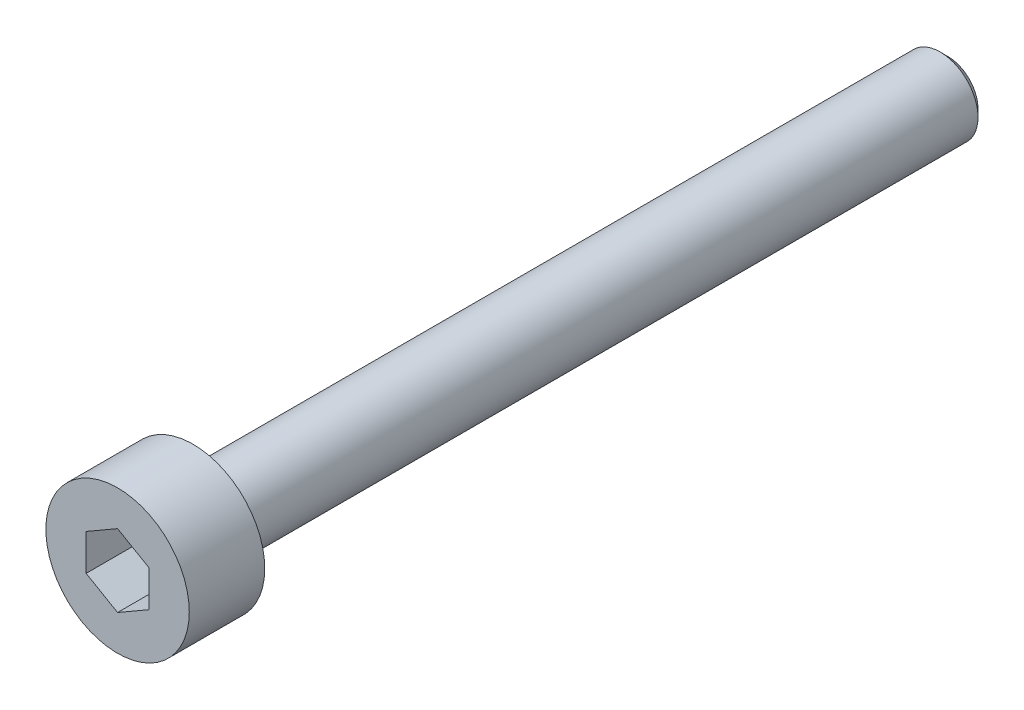
ISO-10303-21;
HEADER;
FILE_DESCRIPTION(('STEP AP214'),'2;1');
FILE_NAME('part.step','',(''),(''),'','','');
FILE_SCHEMA(('AUTOMOTIVE_DESIGN { 1 0 10303 214 1 1 1 1 }'));
ENDSEC;
DATA;
#1=APPLICATION_CONTEXT('core data for automotive mechanical design processes');
#2=APPLICATION_PROTOCOL_DEFINITION('international standard','automotive_design',2000,#1);
#3=PRODUCT_CONTEXT('',#1,'mechanical');
#4=PRODUCT('Part','Part','',(#3));
#5=PRODUCT_RELATED_PRODUCT_CATEGORY('part','',(#4));
#6=PRODUCT_DEFINITION_FORMATION('','',#4);
#7=PRODUCT_DEFINITION_CONTEXT('part definition',#1,'design');
#8=PRODUCT_DEFINITION('design','',#6,#7);
#9=PRODUCT_DEFINITION_SHAPE('','',#8);
#10=(LENGTH_UNIT() NAMED_UNIT(*) SI_UNIT(.MILLI.,.METRE.));
#11=(NAMED_UNIT(*) PLANE_ANGLE_UNIT() SI_UNIT($,.RADIAN.));
#12=(NAMED_UNIT(*) SI_UNIT($,.STERADIAN.) SOLID_ANGLE_UNIT());
#13=UNCERTAINTY_MEASURE_WITH_UNIT(LENGTH_MEASURE(1.E-05),#10,'distance_accuracy_value','');
#14=(GEOMETRIC_REPRESENTATION_CONTEXT(3) GLOBAL_UNCERTAINTY_ASSIGNED_CONTEXT((#13)) GLOBAL_UNIT_ASSIGNED_CONTEXT((#10,
#11,#12)) REPRESENTATION_CONTEXT('',''));
#15=CARTESIAN_POINT('',(0.,0.,0.));
#16=DIRECTION('',(0.,0.,1.));
#17=DIRECTION('',(1.,0.,0.));
#18=AXIS2_PLACEMENT_3D('',#15,#16,#17);
#19=CARTESIAN_POINT('',(0.,0.,0.));
#20=DIRECTION('',(0.,0.,1.));
#21=DIRECTION('',(1.,0.,0.));
#22=AXIS2_PLACEMENT_3D('',#19,#20,#21);
#23=PLANE('',#22);
#24=CARTESIAN_POINT('',(0.,0.,0.));
#25=DIRECTION('',(0.,0.,1.));
#26=DIRECTION('',(1.,0.,0.));
#27=AXIS2_PLACEMENT_3D('',#24,#25,#26);
#28=CIRCLE('',#27,2.85);
#29=CARTESIAN_POINT('',(2.85,0.,0.));
#30=VERTEX_POINT('',#29);
#31=EDGE_CURVE('E137',#30,#30,#28,.T.);
#32=ORIENTED_EDGE('',*,*,#31,.F.);
#33=EDGE_LOOP('',(#32));
#34=FACE_BOUND('',#33,.T.);
#35=CARTESIAN_POINT('',(0.,0.,0.));
#36=DIRECTION('',(0.,0.,1.));
#37=DIRECTION('',(1.,0.,0.));
#38=AXIS2_PLACEMENT_3D('',#35,#36,#37);
#39=CIRCLE('',#38,1.5);
#40=CARTESIAN_POINT('',(1.5,0.,0.));
#41=VERTEX_POINT('',#40);
#42=EDGE_CURVE('E146',#41,#41,#39,.F.);
#43=ORIENTED_EDGE('',*,*,#42,.F.);
#44=EDGE_LOOP('',(#43));
#45=FACE_BOUND('',#44,.T.);
#46=ADVANCED_FACE('F35',(#34,#45),#23,.F.);
#47=CARTESIAN_POINT('',(0.,0.,3.));
#48=DIRECTION('',(0.,0.,-1.));
#49=DIRECTION('',(-1.,0.,0.));
#50=AXIS2_PLACEMENT_3D('',#47,#48,#49);
#51=CYLINDRICAL_SURFACE('',#50,2.85);
#52=CARTESIAN_POINT('',(0.,0.,3.));
#53=DIRECTION('',(0.,0.,1.));
#54=DIRECTION('',(1.,0.,0.));
#55=AXIS2_PLACEMENT_3D('',#52,#53,#54);
#56=CIRCLE('',#55,2.85);
#57=CARTESIAN_POINT('',(2.85,0.,3.));
#58=VERTEX_POINT('',#57);
#59=EDGE_CURVE('E143',#58,#58,#56,.T.);
#60=ORIENTED_EDGE('',*,*,#59,.F.);
#61=EDGE_LOOP('',(#60));
#62=FACE_BOUND('',#61,.T.);
#63=ORIENTED_EDGE('',*,*,#31,.T.);
#64=EDGE_LOOP('',(#63));
#65=FACE_BOUND('',#64,.T.);
#66=ADVANCED_FACE('F168',(#62,#65),#51,.T.);
#67=CARTESIAN_POINT('',(0.,0.,3.));
#68=DIRECTION('',(0.,0.,1.));
#69=DIRECTION('',(1.,0.,0.));
#70=AXIS2_PLACEMENT_3D('',#67,#68,#69);
#71=PLANE('',#70);
#72=DIRECTION('',(-0.866025403784439,0.5,0.));
#73=VECTOR('',#72,1.);
#74=CARTESIAN_POINT('',(1.25,0.721687836487032,3.));
#75=LINE('',#74,#73);
#76=CARTESIAN_POINT('',(1.25,0.721687836487032,3.));
#77=VERTEX_POINT('',#76);
#78=CARTESIAN_POINT('',(0.,1.44337567297406,3.));
#79=VERTEX_POINT('',#78);
#80=EDGE_CURVE('E50',#77,#79,#75,.T.);
#81=ORIENTED_EDGE('',*,*,#80,.F.);
#82=DIRECTION('',(0.,1.,0.));
#83=VECTOR('',#82,1.);
#84=CARTESIAN_POINT('',(1.25,-0.721687836487032,3.));
#85=LINE('',#84,#83);
#86=CARTESIAN_POINT('',(1.25,-0.721687836487032,3.));
#87=VERTEX_POINT('',#86);
#88=EDGE_CURVE('E133',#87,#77,#85,.T.);
#89=ORIENTED_EDGE('',*,*,#88,.F.);
#90=DIRECTION('',(0.866025403784439,0.5,0.));
#91=VECTOR('',#90,1.);
#92=CARTESIAN_POINT('',(0.,-1.44337567297406,3.));
#93=LINE('',#92,#91);
#94=CARTESIAN_POINT('',(0.,-1.44337567297406,3.));
#95=VERTEX_POINT('',#94);
#96=EDGE_CURVE('E131',#95,#87,#93,.T.);
#97=ORIENTED_EDGE('',*,*,#96,.F.);
#98=DIRECTION('',(0.866025403784439,-0.5,0.));
#99=VECTOR('',#98,1.);
#100=CARTESIAN_POINT('',(-1.25,-0.721687836487033,3.));
#101=LINE('',#100,#99);
#102=CARTESIAN_POINT('',(-1.25,-0.721687836487033,3.));
#103=VERTEX_POINT('',#102);
#104=EDGE_CURVE('E98',#103,#95,#101,.T.);
#105=ORIENTED_EDGE('',*,*,#104,.F.);
#106=DIRECTION('',(0.,-1.,0.));
#107=VECTOR('',#106,1.);
#108=CARTESIAN_POINT('',(-1.25,0.721687836487032,3.));
#109=LINE('',#108,#107);
#110=CARTESIAN_POINT('',(-1.25,0.721687836487032,3.));
#111=VERTEX_POINT('',#110);
#112=EDGE_CURVE('E127',#111,#103,#109,.T.);
#113=ORIENTED_EDGE('',*,*,#112,.F.);
#114=DIRECTION('',(-0.866025403784439,-0.5,0.));
#115=VECTOR('',#114,1.);
#116=CARTESIAN_POINT('',(0.,1.44337567297406,3.));
#117=LINE('',#116,#115);
#118=EDGE_CURVE('E124',#79,#111,#117,.T.);
#119=ORIENTED_EDGE('',*,*,#118,.F.);
#120=EDGE_LOOP('',(#81,#89,#97,#105,#113,#119));
#121=FACE_BOUND('',#120,.T.);
#122=ORIENTED_EDGE('',*,*,#59,.T.);
#123=EDGE_LOOP('',(#122));
#124=FACE_BOUND('',#123,.T.);
#125=ADVANCED_FACE('F174',(#121,#124),#71,.T.);
#126=CARTESIAN_POINT('',(0.,0.,-30.));
#127=DIRECTION('',(0.,0.,1.));
#128=DIRECTION('',(1.,0.,0.));
#129=AXIS2_PLACEMENT_3D('',#126,#127,#128);
#130=CYLINDRICAL_SURFACE('',#129,1.5);
#131=CARTESIAN_POINT('',(0.,0.,-29.7));
#132=DIRECTION('',(0.,0.,-1.));
#133=DIRECTION('',(-1.,0.,0.));
#134=AXIS2_PLACEMENT_3D('',#131,#132,#133);
#135=CIRCLE('',#134,1.5);
#136=CARTESIAN_POINT('',(-1.5,0.,-29.7));
#137=VERTEX_POINT('',#136);
#138=EDGE_CURVE('E11',#137,#137,#135,.F.);
#139=ORIENTED_EDGE('',*,*,#138,.T.);
#140=EDGE_LOOP('',(#139));
#141=FACE_BOUND('',#140,.T.);
#142=ORIENTED_EDGE('',*,*,#42,.T.);
#143=EDGE_LOOP('',(#142));
#144=FACE_BOUND('',#143,.T.);
#145=ADVANCED_FACE('F164',(#141,#144),#130,.T.);
#146=CARTESIAN_POINT('',(0.,0.,-30.));
#147=DIRECTION('',(0.,0.,-1.));
#148=DIRECTION('',(-1.,0.,0.));
#149=AXIS2_PLACEMENT_3D('',#146,#147,#148);
#150=PLANE('',#149);
#151=CARTESIAN_POINT('',(0.,0.,-30.));
#152=DIRECTION('',(0.,0.,-1.));
#153=DIRECTION('',(-1.,0.,0.));
#154=AXIS2_PLACEMENT_3D('',#151,#152,#153);
#155=CIRCLE('',#154,1.19999999999999);
#156=CARTESIAN_POINT('',(-1.19999999999999,0.,-30.));
#157=VERTEX_POINT('',#156);
#158=EDGE_CURVE('E43',#157,#157,#155,.T.);
#159=ORIENTED_EDGE('',*,*,#158,.T.);
#160=EDGE_LOOP('',(#159));
#161=FACE_BOUND('',#160,.T.);
#162=ADVANCED_FACE('F153',(#161),#150,.T.);
#163=CARTESIAN_POINT('',(0.,0.,-30.));
#164=DIRECTION('',(0.,0.,1.));
#165=DIRECTION('',(1.,0.,0.));
#166=AXIS2_PLACEMENT_3D('',#163,#164,#165);
#167=CONICAL_SURFACE('',#166,1.19999999999999,0.785398163397447);
#168=ORIENTED_EDGE('',*,*,#138,.F.);
#169=EDGE_LOOP('',(#168));
#170=FACE_BOUND('',#169,.T.);
#171=ORIENTED_EDGE('',*,*,#158,.F.);
#172=EDGE_LOOP('',(#171));
#173=FACE_BOUND('',#172,.T.);
#174=ADVANCED_FACE('F37',(#170,#173),#167,.T.);
#175=CARTESIAN_POINT('',(1.25,0.721687836487032,1.));
#176=DIRECTION('',(0.5,0.866025403784439,0.));
#177=DIRECTION('',(-0.866025403784439,0.5,0.));
#178=AXIS2_PLACEMENT_3D('',#175,#176,#177);
#179=PLANE('',#178);
#180=ORIENTED_EDGE('',*,*,#80,.T.);
#181=DIRECTION('',(0.,0.,1.));
#182=VECTOR('',#181,1.);
#183=CARTESIAN_POINT('',(0.,1.44337567297406,1.));
#184=LINE('',#183,#182);
#185=CARTESIAN_POINT('',(0.,1.44337567297406,1.));
#186=VERTEX_POINT('',#185);
#187=EDGE_CURVE('E80',#186,#79,#184,.T.);
#188=ORIENTED_EDGE('',*,*,#187,.F.);
#189=DIRECTION('',(-0.866025403784439,0.5,0.));
#190=VECTOR('',#189,1.);
#191=CARTESIAN_POINT('',(1.25,0.721687836487032,1.));
#192=LINE('',#191,#190);
#193=CARTESIAN_POINT('',(1.25,0.721687836487032,1.));
#194=VERTEX_POINT('',#193);
#195=EDGE_CURVE('E135',#194,#186,#192,.T.);
#196=ORIENTED_EDGE('',*,*,#195,.F.);
#197=DIRECTION('',(0.,0.,1.));
#198=VECTOR('',#197,1.);
#199=CARTESIAN_POINT('',(1.25,0.721687836487032,1.));
#200=LINE('',#199,#198);
#201=EDGE_CURVE('E58',#194,#77,#200,.T.);
#202=ORIENTED_EDGE('',*,*,#201,.T.);
#203=EDGE_LOOP('',(#180,#188,#196,#202));
#204=FACE_BOUND('',#203,.T.);
#205=ADVANCED_FACE('F156',(#204),#179,.F.);
#206=CARTESIAN_POINT('',(1.25,-0.721687836487032,1.));
#207=DIRECTION('',(1.,0.,0.));
#208=DIRECTION('',(0.,1.,0.));
#209=AXIS2_PLACEMENT_3D('',#206,#207,#208);
#210=PLANE('',#209);
#211=ORIENTED_EDGE('',*,*,#88,.T.);
#212=ORIENTED_EDGE('',*,*,#201,.F.);
#213=DIRECTION('',(0.,1.,0.));
#214=VECTOR('',#213,1.);
#215=CARTESIAN_POINT('',(1.25,-0.721687836487032,1.));
#216=LINE('',#215,#214);
#217=CARTESIAN_POINT('',(1.25,-0.721687836487032,1.));
#218=VERTEX_POINT('',#217);
#219=EDGE_CURVE('E110',#218,#194,#216,.T.);
#220=ORIENTED_EDGE('',*,*,#219,.F.);
#221=DIRECTION('',(0.,0.,1.));
#222=VECTOR('',#221,1.);
#223=CARTESIAN_POINT('',(1.25,-0.721687836487032,1.));
#224=LINE('',#223,#222);
#225=EDGE_CURVE('E102',#218,#87,#224,.T.);
#226=ORIENTED_EDGE('',*,*,#225,.T.);
#227=EDGE_LOOP('',(#211,#212,#220,#226));
#228=FACE_BOUND('',#227,.T.);
#229=ADVANCED_FACE('F162',(#228),#210,.F.);
#230=CARTESIAN_POINT('',(0.,-1.44337567297406,1.));
#231=DIRECTION('',(0.5,-0.866025403784439,0.));
#232=DIRECTION('',(0.866025403784439,0.5,0.));
#233=AXIS2_PLACEMENT_3D('',#230,#231,#232);
#234=PLANE('',#233);
#235=ORIENTED_EDGE('',*,*,#96,.T.);
#236=ORIENTED_EDGE('',*,*,#225,.F.);
#237=DIRECTION('',(0.866025403784439,0.5,0.));
#238=VECTOR('',#237,1.);
#239=CARTESIAN_POINT('',(0.,-1.44337567297406,1.));
#240=LINE('',#239,#238);
#241=CARTESIAN_POINT('',(0.,-1.44337567297406,1.));
#242=VERTEX_POINT('',#241);
#243=EDGE_CURVE('E106',#242,#218,#240,.T.);
#244=ORIENTED_EDGE('',*,*,#243,.F.);
#245=DIRECTION('',(0.,0.,1.));
#246=VECTOR('',#245,1.);
#247=CARTESIAN_POINT('',(0.,-1.44337567297406,1.));
#248=LINE('',#247,#246);
#249=EDGE_CURVE('E91',#242,#95,#248,.T.);
#250=ORIENTED_EDGE('',*,*,#249,.T.);
#251=EDGE_LOOP('',(#235,#236,#244,#250));
#252=FACE_BOUND('',#251,.T.);
#253=ADVANCED_FACE('F107',(#252),#234,.F.);
#254=CARTESIAN_POINT('',(-1.25,-0.721687836487033,1.));
#255=DIRECTION('',(-0.5,-0.866025403784439,0.));
#256=DIRECTION('',(0.866025403784439,-0.5,0.));
#257=AXIS2_PLACEMENT_3D('',#254,#255,#256);
#258=PLANE('',#257);
#259=ORIENTED_EDGE('',*,*,#104,.T.);
#260=ORIENTED_EDGE('',*,*,#249,.F.);
#261=DIRECTION('',(0.866025403784439,-0.5,0.));
#262=VECTOR('',#261,1.);
#263=CARTESIAN_POINT('',(-1.25,-0.721687836487033,1.));
#264=LINE('',#263,#262);
#265=CARTESIAN_POINT('',(-1.25,-0.721687836487033,1.));
#266=VERTEX_POINT('',#265);
#267=EDGE_CURVE('E95',#266,#242,#264,.T.);
#268=ORIENTED_EDGE('',*,*,#267,.F.);
#269=DIRECTION('',(0.,0.,1.));
#270=VECTOR('',#269,1.);
#271=CARTESIAN_POINT('',(-1.25,-0.721687836487033,1.));
#272=LINE('',#271,#270);
#273=EDGE_CURVE('E103',#266,#103,#272,.T.);
#274=ORIENTED_EDGE('',*,*,#273,.T.);
#275=EDGE_LOOP('',(#259,#260,#268,#274));
#276=FACE_BOUND('',#275,.T.);
#277=ADVANCED_FACE('F93',(#276),#258,.F.);
#278=CARTESIAN_POINT('',(-1.25,0.721687836487032,1.));
#279=DIRECTION('',(-1.,0.,0.));
#280=DIRECTION('',(0.,0.,1.));
#281=AXIS2_PLACEMENT_3D('',#278,#279,#280);
#282=PLANE('',#281);
#283=ORIENTED_EDGE('',*,*,#112,.T.);
#284=ORIENTED_EDGE('',*,*,#273,.F.);
#285=DIRECTION('',(0.,-1.,0.));
#286=VECTOR('',#285,1.);
#287=CARTESIAN_POINT('',(-1.25,0.721687836487032,1.));
#288=LINE('',#287,#286);
#289=CARTESIAN_POINT('',(-1.25,0.721687836487032,1.));
#290=VERTEX_POINT('',#289);
#291=EDGE_CURVE('E116',#290,#266,#288,.T.);
#292=ORIENTED_EDGE('',*,*,#291,.F.);
#293=DIRECTION('',(0.,0.,1.));
#294=VECTOR('',#293,1.);
#295=CARTESIAN_POINT('',(-1.25,0.721687836487032,1.));
#296=LINE('',#295,#294);
#297=EDGE_CURVE('E140',#290,#111,#296,.T.);
#298=ORIENTED_EDGE('',*,*,#297,.T.);
#299=EDGE_LOOP('',(#283,#284,#292,#298));
#300=FACE_BOUND('',#299,.T.);
#301=ADVANCED_FACE('F188',(#300),#282,.F.);
#302=CARTESIAN_POINT('',(0.,1.44337567297406,1.));
#303=DIRECTION('',(-0.5,0.866025403784439,0.));
#304=DIRECTION('',(-0.866025403784439,-0.5,0.));
#305=AXIS2_PLACEMENT_3D('',#302,#303,#304);
#306=PLANE('',#305);
#307=ORIENTED_EDGE('',*,*,#118,.T.);
#308=ORIENTED_EDGE('',*,*,#297,.F.);
#309=DIRECTION('',(-0.866025403784439,-0.5,0.));
#310=VECTOR('',#309,1.);
#311=CARTESIAN_POINT('',(0.,1.44337567297406,1.));
#312=LINE('',#311,#310);
#313=EDGE_CURVE('E118',#186,#290,#312,.T.);
#314=ORIENTED_EDGE('',*,*,#313,.F.);
#315=ORIENTED_EDGE('',*,*,#187,.T.);
#316=EDGE_LOOP('',(#307,#308,#314,#315));
#317=FACE_BOUND('',#316,.T.);
#318=ADVANCED_FACE('F185',(#317),#306,.F.);
#319=CARTESIAN_POINT('',(0.,0.,1.));
#320=DIRECTION('',(0.,0.,1.));
#321=DIRECTION('',(1.,0.,0.));
#322=AXIS2_PLACEMENT_3D('',#319,#320,#321);
#323=PLANE('',#322);
#324=ORIENTED_EDGE('',*,*,#195,.T.);
#325=ORIENTED_EDGE('',*,*,#313,.T.);
#326=ORIENTED_EDGE('',*,*,#291,.T.);
#327=ORIENTED_EDGE('',*,*,#267,.T.);
#328=ORIENTED_EDGE('',*,*,#243,.T.);
#329=ORIENTED_EDGE('',*,*,#219,.T.);
#330=EDGE_LOOP('',(#324,#325,#326,#327,#328,#329));
#331=FACE_BOUND('',#330,.T.);
#332=ADVANCED_FACE('F113',(#331),#323,.T.);
#333=CLOSED_SHELL('',(#46,#66,#125,#145,#162,#174,#205,#229,#253,#277,#301,#318,#332));
#334=MANIFOLD_SOLID_BREP('B2',#333);
#335=ADVANCED_BREP_SHAPE_REPRESENTATION('',(#18,#334),#14);
#336=SHAPE_DEFINITION_REPRESENTATION(#9,#335);
ENDSEC;
END-ISO-10303-21;
